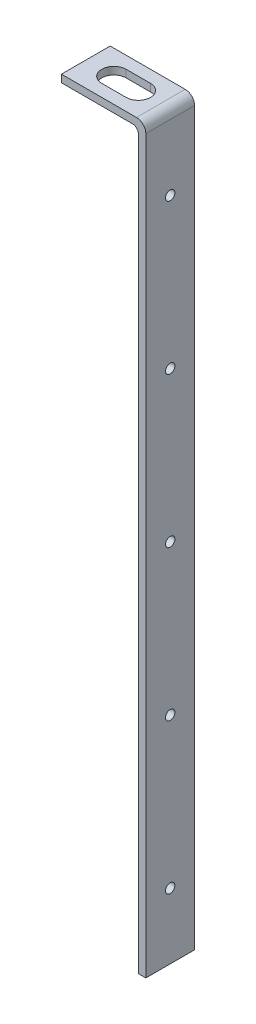
ISO-10303-21;
HEADER;
FILE_DESCRIPTION(('STEP AP214'),'2;1');
FILE_NAME('part.step','',(''),(''),'','','');
FILE_SCHEMA(('AUTOMOTIVE_DESIGN { 1 0 10303 214 1 1 1 1 }'));
ENDSEC;
DATA;
#1=APPLICATION_CONTEXT('core data for automotive mechanical design processes');
#2=APPLICATION_PROTOCOL_DEFINITION('international standard','automotive_design',2000,#1);
#3=PRODUCT_CONTEXT('',#1,'mechanical');
#4=PRODUCT('Part','Part','',(#3));
#5=PRODUCT_RELATED_PRODUCT_CATEGORY('part','',(#4));
#6=PRODUCT_DEFINITION_FORMATION('','',#4);
#7=PRODUCT_DEFINITION_CONTEXT('part definition',#1,'design');
#8=PRODUCT_DEFINITION('design','',#6,#7);
#9=PRODUCT_DEFINITION_SHAPE('','',#8);
#10=(LENGTH_UNIT() NAMED_UNIT(*) SI_UNIT(.MILLI.,.METRE.));
#11=(NAMED_UNIT(*) PLANE_ANGLE_UNIT() SI_UNIT($,.RADIAN.));
#12=(NAMED_UNIT(*) SI_UNIT($,.STERADIAN.) SOLID_ANGLE_UNIT());
#13=UNCERTAINTY_MEASURE_WITH_UNIT(LENGTH_MEASURE(1.E-05),#10,'distance_accuracy_value','');
#14=(GEOMETRIC_REPRESENTATION_CONTEXT(3) GLOBAL_UNCERTAINTY_ASSIGNED_CONTEXT((#13)) GLOBAL_UNIT_ASSIGNED_CONTEXT((#10,
#11,#12)) REPRESENTATION_CONTEXT('',''));
#15=CARTESIAN_POINT('',(0.,0.,0.));
#16=DIRECTION('',(0.,0.,1.));
#17=DIRECTION('',(1.,0.,0.));
#18=AXIS2_PLACEMENT_3D('',#15,#16,#17);
#19=CARTESIAN_POINT('',(-4.,0.,26.));
#20=DIRECTION('',(0.,1.,0.));
#21=DIRECTION('',(0.,0.,1.));
#22=AXIS2_PLACEMENT_3D('',#19,#20,#21);
#23=PLANE('',#22);
#24=DIRECTION('',(1.,0.,0.));
#25=VECTOR('',#24,1.);
#26=CARTESIAN_POINT('',(-4.,0.,0.));
#27=LINE('',#26,#25);
#28=CARTESIAN_POINT('',(-4.,0.,0.));
#29=VERTEX_POINT('',#28);
#30=CARTESIAN_POINT('',(0.,0.,0.));
#31=VERTEX_POINT('',#30);
#32=EDGE_CURVE('E222',#29,#31,#27,.T.);
#33=ORIENTED_EDGE('',*,*,#32,.T.);
#34=DIRECTION('',(0.,0.,-1.));
#35=VECTOR('',#34,1.);
#36=CARTESIAN_POINT('',(0.,0.,26.));
#37=LINE('',#36,#35);
#38=CARTESIAN_POINT('',(0.,0.,26.));
#39=VERTEX_POINT('',#38);
#40=EDGE_CURVE('E253',#39,#31,#37,.T.);
#41=ORIENTED_EDGE('',*,*,#40,.F.);
#42=DIRECTION('',(1.,0.,0.));
#43=VECTOR('',#42,1.);
#44=CARTESIAN_POINT('',(-4.,0.,26.));
#45=LINE('',#44,#43);
#46=CARTESIAN_POINT('',(-4.,0.,26.));
#47=VERTEX_POINT('',#46);
#48=EDGE_CURVE('E200',#47,#39,#45,.T.);
#49=ORIENTED_EDGE('',*,*,#48,.F.);
#50=DIRECTION('',(0.,0.,-1.));
#51=VECTOR('',#50,1.);
#52=CARTESIAN_POINT('',(-4.,0.,26.));
#53=LINE('',#52,#51);
#54=EDGE_CURVE('E221',#47,#29,#53,.T.);
#55=ORIENTED_EDGE('',*,*,#54,.T.);
#56=EDGE_LOOP('',(#33,#41,#49,#55));
#57=FACE_BOUND('',#56,.T.);
#58=ADVANCED_FACE('F47',(#57),#23,.F.);
#59=CARTESIAN_POINT('',(0.,0.,26.));
#60=DIRECTION('',(-1.,0.,0.));
#61=DIRECTION('',(0.,0.,1.));
#62=AXIS2_PLACEMENT_3D('',#59,#60,#61);
#63=PLANE('',#62);
#64=CARTESIAN_POINT('',(0.,355.,13.));
#65=DIRECTION('',(1.,0.,0.));
#66=DIRECTION('',(0.,0.,-1.));
#67=AXIS2_PLACEMENT_3D('',#64,#65,#66);
#68=CIRCLE('',#67,2.5);
#69=CARTESIAN_POINT('',(0.,355.,10.5));
#70=VERTEX_POINT('',#69);
#71=EDGE_CURVE('E175',#70,#70,#68,.T.);
#72=ORIENTED_EDGE('',*,*,#71,.F.);
#73=EDGE_LOOP('',(#72));
#74=FACE_BOUND('',#73,.T.);
#75=CARTESIAN_POINT('',(0.,275.,13.));
#76=DIRECTION('',(1.,0.,0.));
#77=DIRECTION('',(0.,0.,-1.));
#78=AXIS2_PLACEMENT_3D('',#75,#76,#77);
#79=CIRCLE('',#78,2.5);
#80=CARTESIAN_POINT('',(0.,275.,10.5));
#81=VERTEX_POINT('',#80);
#82=EDGE_CURVE('E189',#81,#81,#79,.T.);
#83=ORIENTED_EDGE('',*,*,#82,.F.);
#84=EDGE_LOOP('',(#83));
#85=FACE_BOUND('',#84,.T.);
#86=CARTESIAN_POINT('',(0.,35.,13.));
#87=DIRECTION('',(1.,0.,0.));
#88=DIRECTION('',(0.,0.,-1.));
#89=AXIS2_PLACEMENT_3D('',#86,#87,#88);
#90=CIRCLE('',#89,2.5);
#91=CARTESIAN_POINT('',(0.,35.,10.5));
#92=VERTEX_POINT('',#91);
#93=EDGE_CURVE('E185',#92,#92,#90,.T.);
#94=ORIENTED_EDGE('',*,*,#93,.F.);
#95=EDGE_LOOP('',(#94));
#96=FACE_BOUND('',#95,.T.);
#97=CARTESIAN_POINT('',(0.,115.,13.));
#98=DIRECTION('',(1.,0.,0.));
#99=DIRECTION('',(0.,0.,-1.));
#100=AXIS2_PLACEMENT_3D('',#97,#98,#99);
#101=CIRCLE('',#100,2.5);
#102=CARTESIAN_POINT('',(0.,115.,10.5));
#103=VERTEX_POINT('',#102);
#104=EDGE_CURVE('E180',#103,#103,#101,.T.);
#105=ORIENTED_EDGE('',*,*,#104,.F.);
#106=EDGE_LOOP('',(#105));
#107=FACE_BOUND('',#106,.T.);
#108=CARTESIAN_POINT('',(0.,195.,13.));
#109=DIRECTION('',(1.,0.,0.));
#110=DIRECTION('',(0.,0.,-1.));
#111=AXIS2_PLACEMENT_3D('',#108,#109,#110);
#112=CIRCLE('',#111,2.5);
#113=CARTESIAN_POINT('',(0.,195.,10.5));
#114=VERTEX_POINT('',#113);
#115=EDGE_CURVE('E184',#114,#114,#112,.T.);
#116=ORIENTED_EDGE('',*,*,#115,.F.);
#117=EDGE_LOOP('',(#116));
#118=FACE_BOUND('',#117,.T.);
#119=DIRECTION('',(0.,1.,0.));
#120=VECTOR('',#119,1.);
#121=CARTESIAN_POINT('',(0.,0.,0.));
#122=LINE('',#121,#120);
#123=CARTESIAN_POINT('',(0.,390.,0.));
#124=VERTEX_POINT('',#123);
#125=EDGE_CURVE('E226',#31,#124,#122,.T.);
#126=ORIENTED_EDGE('',*,*,#125,.T.);
#127=DIRECTION('',(0.,0.,-1.));
#128=VECTOR('',#127,1.);
#129=CARTESIAN_POINT('',(0.,390.,26.));
#130=LINE('',#129,#128);
#131=CARTESIAN_POINT('',(0.,390.,26.));
#132=VERTEX_POINT('',#131);
#133=EDGE_CURVE('E56',#124,#132,#130,.F.);
#134=ORIENTED_EDGE('',*,*,#133,.T.);
#135=DIRECTION('',(0.,1.,0.));
#136=VECTOR('',#135,1.);
#137=CARTESIAN_POINT('',(0.,0.,26.));
#138=LINE('',#137,#136);
#139=EDGE_CURVE('E204',#39,#132,#138,.T.);
#140=ORIENTED_EDGE('',*,*,#139,.F.);
#141=ORIENTED_EDGE('',*,*,#40,.T.);
#142=EDGE_LOOP('',(#126,#134,#140,#141));
#143=FACE_BOUND('',#142,.T.);
#144=ADVANCED_FACE('F444',(#74,#85,#96,#107,#118,#143),#63,.F.);
#145=CARTESIAN_POINT('',(0.,395.,26.));
#146=DIRECTION('',(0.,-1.,0.));
#147=DIRECTION('',(0.,0.,-1.));
#148=AXIS2_PLACEMENT_3D('',#145,#146,#147);
#149=PLANE('',#148);
#150=DIRECTION('',(1.,0.,0.));
#151=VECTOR('',#150,1.);
#152=CARTESIAN_POINT('',(-30.,395.,19.5));
#153=LINE('',#152,#151);
#154=CARTESIAN_POINT('',(-30.0000000000003,395.,19.5));
#155=VERTEX_POINT('',#154);
#156=CARTESIAN_POINT('',(-17.,395.,19.5));
#157=VERTEX_POINT('',#156);
#158=EDGE_CURVE('E152',#155,#157,#153,.T.);
#159=ORIENTED_EDGE('',*,*,#158,.F.);
#160=CARTESIAN_POINT('',(-30.,395.,13.));
#161=DIRECTION('',(0.,1.,0.));
#162=DIRECTION('',(-1.,0.,0.));
#163=AXIS2_PLACEMENT_3D('',#160,#161,#162);
#164=CIRCLE('',#163,6.5);
#165=CARTESIAN_POINT('',(-30.,395.,6.5));
#166=VERTEX_POINT('',#165);
#167=EDGE_CURVE('E158',#166,#155,#164,.T.);
#168=ORIENTED_EDGE('',*,*,#167,.F.);
#169=DIRECTION('',(-1.,0.,0.));
#170=VECTOR('',#169,1.);
#171=CARTESIAN_POINT('',(-30.,395.,6.5));
#172=LINE('',#171,#170);
#173=CARTESIAN_POINT('',(-17.,395.,6.5));
#174=VERTEX_POINT('',#173);
#175=EDGE_CURVE('E163',#174,#166,#172,.T.);
#176=ORIENTED_EDGE('',*,*,#175,.F.);
#177=CARTESIAN_POINT('',(-17.,395.,13.));
#178=DIRECTION('',(0.,1.,0.));
#179=DIRECTION('',(-1.,0.,0.));
#180=AXIS2_PLACEMENT_3D('',#177,#178,#179);
#181=CIRCLE('',#180,6.5);
#182=EDGE_CURVE('E140',#157,#174,#181,.T.);
#183=ORIENTED_EDGE('',*,*,#182,.F.);
#184=EDGE_LOOP('',(#159,#168,#176,#183));
#185=FACE_BOUND('',#184,.T.);
#186=DIRECTION('',(-1.,0.,0.));
#187=VECTOR('',#186,1.);
#188=CARTESIAN_POINT('',(0.,395.,26.));
#189=LINE('',#188,#187);
#190=CARTESIAN_POINT('',(-5.,395.,26.));
#191=VERTEX_POINT('',#190);
#192=CARTESIAN_POINT('',(-45.,395.,26.));
#193=VERTEX_POINT('',#192);
#194=EDGE_CURVE('E208',#191,#193,#189,.T.);
#195=ORIENTED_EDGE('',*,*,#194,.F.);
#196=DIRECTION('',(0.,0.,-1.));
#197=VECTOR('',#196,1.);
#198=CARTESIAN_POINT('',(-5.,395.,26.));
#199=LINE('',#198,#197);
#200=CARTESIAN_POINT('',(-5.,395.,0.));
#201=VERTEX_POINT('',#200);
#202=EDGE_CURVE('E301',#191,#201,#199,.T.);
#203=ORIENTED_EDGE('',*,*,#202,.T.);
#204=DIRECTION('',(-1.,0.,0.));
#205=VECTOR('',#204,1.);
#206=CARTESIAN_POINT('',(0.,395.,0.));
#207=LINE('',#206,#205);
#208=CARTESIAN_POINT('',(-45.,395.,0.));
#209=VERTEX_POINT('',#208);
#210=EDGE_CURVE('E230',#201,#209,#207,.T.);
#211=ORIENTED_EDGE('',*,*,#210,.T.);
#212=DIRECTION('',(0.,0.,-1.));
#213=VECTOR('',#212,1.);
#214=CARTESIAN_POINT('',(-45.,395.,26.));
#215=LINE('',#214,#213);
#216=EDGE_CURVE('E249',#193,#209,#215,.T.);
#217=ORIENTED_EDGE('',*,*,#216,.F.);
#218=EDGE_LOOP('',(#195,#203,#211,#217));
#219=FACE_BOUND('',#218,.T.);
#220=ADVANCED_FACE('F160',(#185,#219),#149,.F.);
#221=CARTESIAN_POINT('',(-45.,395.,26.));
#222=DIRECTION('',(1.,0.,0.));
#223=DIRECTION('',(0.,0.,-1.));
#224=AXIS2_PLACEMENT_3D('',#221,#222,#223);
#225=PLANE('',#224);
#226=DIRECTION('',(0.,-1.,0.));
#227=VECTOR('',#226,1.);
#228=CARTESIAN_POINT('',(-45.,395.,0.));
#229=LINE('',#228,#227);
#230=CARTESIAN_POINT('',(-45.,391.,0.));
#231=VERTEX_POINT('',#230);
#232=EDGE_CURVE('E233',#209,#231,#229,.T.);
#233=ORIENTED_EDGE('',*,*,#232,.T.);
#234=DIRECTION('',(0.,0.,-1.));
#235=VECTOR('',#234,1.);
#236=CARTESIAN_POINT('',(-45.,391.,26.));
#237=LINE('',#236,#235);
#238=CARTESIAN_POINT('',(-45.,391.,26.));
#239=VERTEX_POINT('',#238);
#240=EDGE_CURVE('E245',#239,#231,#237,.T.);
#241=ORIENTED_EDGE('',*,*,#240,.F.);
#242=DIRECTION('',(0.,-1.,0.));
#243=VECTOR('',#242,1.);
#244=CARTESIAN_POINT('',(-45.,395.,26.));
#245=LINE('',#244,#243);
#246=EDGE_CURVE('E211',#193,#239,#245,.T.);
#247=ORIENTED_EDGE('',*,*,#246,.F.);
#248=ORIENTED_EDGE('',*,*,#216,.T.);
#249=EDGE_LOOP('',(#233,#241,#247,#248));
#250=FACE_BOUND('',#249,.T.);
#251=ADVANCED_FACE('F408',(#250),#225,.F.);
#252=CARTESIAN_POINT('',(-4.,391.,26.));
#253=DIRECTION('',(0.,1.,0.));
#254=DIRECTION('',(0.,0.,1.));
#255=AXIS2_PLACEMENT_3D('',#252,#253,#254);
#256=PLANE('',#255);
#257=DIRECTION('',(-1.,0.,0.));
#258=VECTOR('',#257,1.);
#259=CARTESIAN_POINT('',(-4.,391.,6.5));
#260=LINE('',#259,#258);
#261=CARTESIAN_POINT('',(-17.,391.,6.5));
#262=VERTEX_POINT('',#261);
#263=CARTESIAN_POINT('',(-30.,391.,6.5));
#264=VERTEX_POINT('',#263);
#265=EDGE_CURVE('E280',#262,#264,#260,.T.);
#266=ORIENTED_EDGE('',*,*,#265,.T.);
#267=CARTESIAN_POINT('',(-30.,391.,13.));
#268=DIRECTION('',(0.,1.,0.));
#269=DIRECTION('',(0.,0.,1.));
#270=AXIS2_PLACEMENT_3D('',#267,#268,#269);
#271=CIRCLE('',#270,6.5);
#272=CARTESIAN_POINT('',(-30.,391.,19.5));
#273=VERTEX_POINT('',#272);
#274=EDGE_CURVE('E284',#264,#273,#271,.T.);
#275=ORIENTED_EDGE('',*,*,#274,.T.);
#276=DIRECTION('',(1.,0.,0.));
#277=VECTOR('',#276,1.);
#278=CARTESIAN_POINT('',(-4.,391.,19.5));
#279=LINE('',#278,#277);
#280=CARTESIAN_POINT('',(-17.,391.,19.5));
#281=VERTEX_POINT('',#280);
#282=EDGE_CURVE('E257',#273,#281,#279,.T.);
#283=ORIENTED_EDGE('',*,*,#282,.T.);
#284=CARTESIAN_POINT('',(-17.,391.,13.));
#285=DIRECTION('',(0.,1.,0.));
#286=DIRECTION('',(0.,0.,1.));
#287=AXIS2_PLACEMENT_3D('',#284,#285,#286);
#288=CIRCLE('',#287,6.5);
#289=EDGE_CURVE('E143',#281,#262,#288,.T.);
#290=ORIENTED_EDGE('',*,*,#289,.T.);
#291=EDGE_LOOP('',(#266,#275,#283,#290));
#292=FACE_BOUND('',#291,.T.);
#293=DIRECTION('',(1.,0.,0.));
#294=VECTOR('',#293,1.);
#295=CARTESIAN_POINT('',(-4.,391.,0.));
#296=LINE('',#295,#294);
#297=CARTESIAN_POINT('',(-7.,391.,0.));
#298=VERTEX_POINT('',#297);
#299=EDGE_CURVE('E236',#231,#298,#296,.T.);
#300=ORIENTED_EDGE('',*,*,#299,.T.);
#301=DIRECTION('',(0.,0.,-1.));
#302=VECTOR('',#301,1.);
#303=CARTESIAN_POINT('',(-7.,391.,26.));
#304=LINE('',#303,#302);
#305=CARTESIAN_POINT('',(-7.,391.,26.));
#306=VERTEX_POINT('',#305);
#307=EDGE_CURVE('E292',#298,#306,#304,.F.);
#308=ORIENTED_EDGE('',*,*,#307,.T.);
#309=DIRECTION('',(1.,0.,0.));
#310=VECTOR('',#309,1.);
#311=CARTESIAN_POINT('',(-4.,391.,26.));
#312=LINE('',#311,#310);
#313=EDGE_CURVE('E214',#239,#306,#312,.T.);
#314=ORIENTED_EDGE('',*,*,#313,.F.);
#315=ORIENTED_EDGE('',*,*,#240,.T.);
#316=EDGE_LOOP('',(#300,#308,#314,#315));
#317=FACE_BOUND('',#316,.T.);
#318=ADVANCED_FACE('F404',(#292,#317),#256,.F.);
#319=CARTESIAN_POINT('',(-4.,0.,26.));
#320=DIRECTION('',(1.,0.,0.));
#321=DIRECTION('',(0.,0.,-1.));
#322=AXIS2_PLACEMENT_3D('',#319,#320,#321);
#323=PLANE('',#322);
#324=CARTESIAN_POINT('',(-4.00000000000001,355.,13.));
#325=DIRECTION('',(1.,0.,0.));
#326=DIRECTION('',(0.,0.,-1.));
#327=AXIS2_PLACEMENT_3D('',#324,#325,#326);
#328=CIRCLE('',#327,2.5);
#329=CARTESIAN_POINT('',(-4.00000000000001,355.,10.5));
#330=VERTEX_POINT('',#329);
#331=EDGE_CURVE('E227',#330,#330,#328,.T.);
#332=ORIENTED_EDGE('',*,*,#331,.T.);
#333=EDGE_LOOP('',(#332));
#334=FACE_BOUND('',#333,.T.);
#335=CARTESIAN_POINT('',(-4.00000000000001,275.,13.));
#336=DIRECTION('',(1.,0.,0.));
#337=DIRECTION('',(0.,0.,-1.));
#338=AXIS2_PLACEMENT_3D('',#335,#336,#337);
#339=CIRCLE('',#338,2.5);
#340=CARTESIAN_POINT('',(-4.00000000000001,275.,10.5));
#341=VERTEX_POINT('',#340);
#342=EDGE_CURVE('E269',#341,#341,#339,.T.);
#343=ORIENTED_EDGE('',*,*,#342,.T.);
#344=EDGE_LOOP('',(#343));
#345=FACE_BOUND('',#344,.T.);
#346=CARTESIAN_POINT('',(-4.00000000000001,35.,13.));
#347=DIRECTION('',(1.,0.,0.));
#348=DIRECTION('',(0.,0.,-1.));
#349=AXIS2_PLACEMENT_3D('',#346,#347,#348);
#350=CIRCLE('',#349,2.5);
#351=CARTESIAN_POINT('',(-4.00000000000001,35.,10.5));
#352=VERTEX_POINT('',#351);
#353=EDGE_CURVE('E265',#352,#352,#350,.T.);
#354=ORIENTED_EDGE('',*,*,#353,.T.);
#355=EDGE_LOOP('',(#354));
#356=FACE_BOUND('',#355,.T.);
#357=CARTESIAN_POINT('',(-4.00000000000001,115.,13.));
#358=DIRECTION('',(1.,0.,0.));
#359=DIRECTION('',(0.,0.,-1.));
#360=AXIS2_PLACEMENT_3D('',#357,#358,#359);
#361=CIRCLE('',#360,2.5);
#362=CARTESIAN_POINT('',(-4.00000000000001,115.,10.5));
#363=VERTEX_POINT('',#362);
#364=EDGE_CURVE('E261',#363,#363,#361,.T.);
#365=ORIENTED_EDGE('',*,*,#364,.T.);
#366=EDGE_LOOP('',(#365));
#367=FACE_BOUND('',#366,.T.);
#368=CARTESIAN_POINT('',(-4.00000000000001,195.,13.));
#369=DIRECTION('',(1.,0.,0.));
#370=DIRECTION('',(0.,0.,-1.));
#371=AXIS2_PLACEMENT_3D('',#368,#369,#370);
#372=CIRCLE('',#371,2.5);
#373=CARTESIAN_POINT('',(-4.00000000000001,195.,10.5));
#374=VERTEX_POINT('',#373);
#375=EDGE_CURVE('E199',#374,#374,#372,.T.);
#376=ORIENTED_EDGE('',*,*,#375,.T.);
#377=EDGE_LOOP('',(#376));
#378=FACE_BOUND('',#377,.T.);
#379=DIRECTION('',(0.,-1.,0.));
#380=VECTOR('',#379,1.);
#381=CARTESIAN_POINT('',(-4.,0.,26.));
#382=LINE('',#381,#380);
#383=CARTESIAN_POINT('',(-4.,388.,26.));
#384=VERTEX_POINT('',#383);
#385=EDGE_CURVE('E218',#384,#47,#382,.T.);
#386=ORIENTED_EDGE('',*,*,#385,.F.);
#387=DIRECTION('',(0.,0.,-1.));
#388=VECTOR('',#387,1.);
#389=CARTESIAN_POINT('',(-4.,388.,0.));
#390=LINE('',#389,#388);
#391=CARTESIAN_POINT('',(-4.,388.,0.));
#392=VERTEX_POINT('',#391);
#393=EDGE_CURVE('E288',#384,#392,#390,.T.);
#394=ORIENTED_EDGE('',*,*,#393,.T.);
#395=DIRECTION('',(0.,-1.,0.));
#396=VECTOR('',#395,1.);
#397=CARTESIAN_POINT('',(-4.,0.,0.));
#398=LINE('',#397,#396);
#399=EDGE_CURVE('E205',#392,#29,#398,.T.);
#400=ORIENTED_EDGE('',*,*,#399,.T.);
#401=ORIENTED_EDGE('',*,*,#54,.F.);
#402=EDGE_LOOP('',(#386,#394,#400,#401));
#403=FACE_BOUND('',#402,.T.);
#404=ADVANCED_FACE('F407',(#334,#345,#356,#367,#378,#403),#323,.F.);
#405=CARTESIAN_POINT('',(0.,0.,26.));
#406=DIRECTION('',(0.,0.,1.));
#407=DIRECTION('',(1.,0.,0.));
#408=AXIS2_PLACEMENT_3D('',#405,#406,#407);
#409=PLANE('',#408);
#410=ORIENTED_EDGE('',*,*,#139,.T.);
#411=CARTESIAN_POINT('',(-5.,390.,26.));
#412=DIRECTION('',(0.,0.,1.));
#413=DIRECTION('',(1.,0.,0.));
#414=AXIS2_PLACEMENT_3D('',#411,#412,#413);
#415=CIRCLE('',#414,5.);
#416=EDGE_CURVE('E11',#132,#191,#415,.T.);
#417=ORIENTED_EDGE('',*,*,#416,.T.);
#418=ORIENTED_EDGE('',*,*,#194,.T.);
#419=ORIENTED_EDGE('',*,*,#246,.T.);
#420=ORIENTED_EDGE('',*,*,#313,.T.);
#421=CARTESIAN_POINT('',(-7.,388.,26.));
#422=DIRECTION('',(0.,0.,1.));
#423=DIRECTION('',(1.,0.,0.));
#424=AXIS2_PLACEMENT_3D('',#421,#422,#423);
#425=CIRCLE('',#424,3.);
#426=EDGE_CURVE('E298',#306,#384,#425,.F.);
#427=ORIENTED_EDGE('',*,*,#426,.T.);
#428=ORIENTED_EDGE('',*,*,#385,.T.);
#429=ORIENTED_EDGE('',*,*,#48,.T.);
#430=EDGE_LOOP('',(#410,#417,#418,#419,#420,#427,#428,#429));
#431=FACE_BOUND('',#430,.T.);
#432=ADVANCED_FACE('F421',(#431),#409,.T.);
#433=CARTESIAN_POINT('',(0.,0.,0.));
#434=DIRECTION('',(0.,0.,1.));
#435=DIRECTION('',(1.,0.,0.));
#436=AXIS2_PLACEMENT_3D('',#433,#434,#435);
#437=PLANE('',#436);
#438=ORIENTED_EDGE('',*,*,#210,.F.);
#439=CARTESIAN_POINT('',(-5.,390.,0.));
#440=DIRECTION('',(0.,0.,1.));
#441=DIRECTION('',(1.,0.,0.));
#442=AXIS2_PLACEMENT_3D('',#439,#440,#441);
#443=CIRCLE('',#442,5.);
#444=EDGE_CURVE('E70',#201,#124,#443,.F.);
#445=ORIENTED_EDGE('',*,*,#444,.T.);
#446=ORIENTED_EDGE('',*,*,#125,.F.);
#447=ORIENTED_EDGE('',*,*,#32,.F.);
#448=ORIENTED_EDGE('',*,*,#399,.F.);
#449=CARTESIAN_POINT('',(-7.,388.,0.));
#450=DIRECTION('',(0.,0.,1.));
#451=DIRECTION('',(1.,0.,0.));
#452=AXIS2_PLACEMENT_3D('',#449,#450,#451);
#453=CIRCLE('',#452,3.);
#454=EDGE_CURVE('E295',#392,#298,#453,.T.);
#455=ORIENTED_EDGE('',*,*,#454,.T.);
#456=ORIENTED_EDGE('',*,*,#299,.F.);
#457=ORIENTED_EDGE('',*,*,#232,.F.);
#458=EDGE_LOOP('',(#438,#445,#446,#447,#448,#455,#456,#457));
#459=FACE_BOUND('',#458,.T.);
#460=ADVANCED_FACE('F434',(#459),#437,.F.);
#461=CARTESIAN_POINT('',(-45.,195.,13.));
#462=DIRECTION('',(1.,0.,0.));
#463=DIRECTION('',(0.,0.,-1.));
#464=AXIS2_PLACEMENT_3D('',#461,#462,#463);
#465=CYLINDRICAL_SURFACE('',#464,2.5);
#466=ORIENTED_EDGE('',*,*,#115,.T.);
#467=EDGE_LOOP('',(#466));
#468=FACE_BOUND('',#467,.T.);
#469=ORIENTED_EDGE('',*,*,#375,.F.);
#470=EDGE_LOOP('',(#469));
#471=FACE_BOUND('',#470,.T.);
#472=ADVANCED_FACE('F472',(#468,#471),#465,.F.);
#473=CARTESIAN_POINT('',(-45.,115.,13.));
#474=DIRECTION('',(1.,0.,0.));
#475=DIRECTION('',(0.,0.,-1.));
#476=AXIS2_PLACEMENT_3D('',#473,#474,#475);
#477=CYLINDRICAL_SURFACE('',#476,2.5);
#478=ORIENTED_EDGE('',*,*,#104,.T.);
#479=EDGE_LOOP('',(#478));
#480=FACE_BOUND('',#479,.T.);
#481=ORIENTED_EDGE('',*,*,#364,.F.);
#482=EDGE_LOOP('',(#481));
#483=FACE_BOUND('',#482,.T.);
#484=ADVANCED_FACE('F468',(#480,#483),#477,.F.);
#485=CARTESIAN_POINT('',(-45.,35.,13.));
#486=DIRECTION('',(1.,0.,0.));
#487=DIRECTION('',(0.,0.,-1.));
#488=AXIS2_PLACEMENT_3D('',#485,#486,#487);
#489=CYLINDRICAL_SURFACE('',#488,2.5);
#490=ORIENTED_EDGE('',*,*,#93,.T.);
#491=EDGE_LOOP('',(#490));
#492=FACE_BOUND('',#491,.T.);
#493=ORIENTED_EDGE('',*,*,#353,.F.);
#494=EDGE_LOOP('',(#493));
#495=FACE_BOUND('',#494,.T.);
#496=ADVANCED_FACE('F471',(#492,#495),#489,.F.);
#497=CARTESIAN_POINT('',(-45.,275.,13.));
#498=DIRECTION('',(1.,0.,0.));
#499=DIRECTION('',(0.,0.,-1.));
#500=AXIS2_PLACEMENT_3D('',#497,#498,#499);
#501=CYLINDRICAL_SURFACE('',#500,2.5);
#502=ORIENTED_EDGE('',*,*,#82,.T.);
#503=EDGE_LOOP('',(#502));
#504=FACE_BOUND('',#503,.T.);
#505=ORIENTED_EDGE('',*,*,#342,.F.);
#506=EDGE_LOOP('',(#505));
#507=FACE_BOUND('',#506,.T.);
#508=ADVANCED_FACE('F476',(#504,#507),#501,.F.);
#509=CARTESIAN_POINT('',(-45.,355.,13.));
#510=DIRECTION('',(1.,0.,0.));
#511=DIRECTION('',(0.,0.,-1.));
#512=AXIS2_PLACEMENT_3D('',#509,#510,#511);
#513=CYLINDRICAL_SURFACE('',#512,2.5);
#514=ORIENTED_EDGE('',*,*,#71,.T.);
#515=EDGE_LOOP('',(#514));
#516=FACE_BOUND('',#515,.T.);
#517=ORIENTED_EDGE('',*,*,#331,.F.);
#518=EDGE_LOOP('',(#517));
#519=FACE_BOUND('',#518,.T.);
#520=ADVANCED_FACE('F467',(#516,#519),#513,.F.);
#521=CARTESIAN_POINT('',(-30.0000000000003,0.,13.));
#522=DIRECTION('',(0.,1.,0.));
#523=DIRECTION('',(-1.,0.,0.));
#524=AXIS2_PLACEMENT_3D('',#521,#522,#523);
#525=CYLINDRICAL_SURFACE('',#524,6.5);
#526=DIRECTION('',(0.,1.,0.));
#527=VECTOR('',#526,1.);
#528=CARTESIAN_POINT('',(-30.0000000000003,0.,6.5));
#529=LINE('',#528,#527);
#530=EDGE_CURVE('E172',#264,#166,#529,.T.);
#531=ORIENTED_EDGE('',*,*,#530,.T.);
#532=ORIENTED_EDGE('',*,*,#167,.T.);
#533=DIRECTION('',(0.,1.,0.));
#534=VECTOR('',#533,1.);
#535=CARTESIAN_POINT('',(-30.0000000000003,0.,19.5));
#536=LINE('',#535,#534);
#537=EDGE_CURVE('E148',#273,#155,#536,.T.);
#538=ORIENTED_EDGE('',*,*,#537,.F.);
#539=ORIENTED_EDGE('',*,*,#274,.F.);
#540=EDGE_LOOP('',(#531,#532,#538,#539));
#541=FACE_BOUND('',#540,.T.);
#542=ADVANCED_FACE('F399',(#541),#525,.F.);
#543=CARTESIAN_POINT('',(-30.0000000000003,0.,6.5));
#544=DIRECTION('',(0.,0.,-1.));
#545=DIRECTION('',(-1.,0.,0.));
#546=AXIS2_PLACEMENT_3D('',#543,#544,#545);
#547=PLANE('',#546);
#548=DIRECTION('',(0.,1.,0.));
#549=VECTOR('',#548,1.);
#550=CARTESIAN_POINT('',(-17.0000000000003,0.,6.5));
#551=LINE('',#550,#549);
#552=EDGE_CURVE('E147',#262,#174,#551,.T.);
#553=ORIENTED_EDGE('',*,*,#552,.T.);
#554=ORIENTED_EDGE('',*,*,#175,.T.);
#555=ORIENTED_EDGE('',*,*,#530,.F.);
#556=ORIENTED_EDGE('',*,*,#265,.F.);
#557=EDGE_LOOP('',(#553,#554,#555,#556));
#558=FACE_BOUND('',#557,.T.);
#559=ADVANCED_FACE('F402',(#558),#547,.F.);
#560=CARTESIAN_POINT('',(-17.0000000000003,0.,13.));
#561=DIRECTION('',(0.,1.,0.));
#562=DIRECTION('',(-1.,0.,0.));
#563=AXIS2_PLACEMENT_3D('',#560,#561,#562);
#564=CYLINDRICAL_SURFACE('',#563,6.5);
#565=DIRECTION('',(0.,1.,0.));
#566=VECTOR('',#565,1.);
#567=CARTESIAN_POINT('',(-17.0000000000003,0.,19.5));
#568=LINE('',#567,#566);
#569=EDGE_CURVE('E135',#281,#157,#568,.T.);
#570=ORIENTED_EDGE('',*,*,#569,.T.);
#571=ORIENTED_EDGE('',*,*,#182,.T.);
#572=ORIENTED_EDGE('',*,*,#552,.F.);
#573=ORIENTED_EDGE('',*,*,#289,.F.);
#574=EDGE_LOOP('',(#570,#571,#572,#573));
#575=FACE_BOUND('',#574,.T.);
#576=ADVANCED_FACE('F137',(#575),#564,.F.);
#577=CARTESIAN_POINT('',(-30.0000000000003,0.,19.5));
#578=DIRECTION('',(0.,0.,1.));
#579=DIRECTION('',(1.,0.,0.));
#580=AXIS2_PLACEMENT_3D('',#577,#578,#579);
#581=PLANE('',#580);
#582=ORIENTED_EDGE('',*,*,#537,.T.);
#583=ORIENTED_EDGE('',*,*,#158,.T.);
#584=ORIENTED_EDGE('',*,*,#569,.F.);
#585=ORIENTED_EDGE('',*,*,#282,.F.);
#586=EDGE_LOOP('',(#582,#583,#584,#585));
#587=FACE_BOUND('',#586,.T.);
#588=ADVANCED_FACE('F153',(#587),#581,.F.);
#589=CARTESIAN_POINT('',(-7.,388.,26.));
#590=DIRECTION('',(0.,0.,1.));
#591=DIRECTION('',(1.,0.,0.));
#592=AXIS2_PLACEMENT_3D('',#589,#590,#591);
#593=CYLINDRICAL_SURFACE('',#592,3.);
#594=ORIENTED_EDGE('',*,*,#426,.F.);
#595=ORIENTED_EDGE('',*,*,#307,.F.);
#596=ORIENTED_EDGE('',*,*,#454,.F.);
#597=ORIENTED_EDGE('',*,*,#393,.F.);
#598=EDGE_LOOP('',(#594,#595,#596,#597));
#599=FACE_BOUND('',#598,.T.);
#600=ADVANCED_FACE('F417',(#599),#593,.F.);
#601=CARTESIAN_POINT('',(-5.,390.,26.));
#602=DIRECTION('',(0.,0.,-1.));
#603=DIRECTION('',(-1.,0.,0.));
#604=AXIS2_PLACEMENT_3D('',#601,#602,#603);
#605=CYLINDRICAL_SURFACE('',#604,5.);
#606=ORIENTED_EDGE('',*,*,#416,.F.);
#607=ORIENTED_EDGE('',*,*,#133,.F.);
#608=ORIENTED_EDGE('',*,*,#444,.F.);
#609=ORIENTED_EDGE('',*,*,#202,.F.);
#610=EDGE_LOOP('',(#606,#607,#608,#609));
#611=FACE_BOUND('',#610,.T.);
#612=ADVANCED_FACE('F49',(#611),#605,.T.);
#613=CLOSED_SHELL('',(#58,#144,#220,#251,#318,#404,#432,#460,#472,#484,#496,#508,#520,#542,#559,
#576,#588,#600,#612));
#614=MANIFOLD_SOLID_BREP('B2',#613);
#615=ADVANCED_BREP_SHAPE_REPRESENTATION('',(#18,#614),#14);
#616=SHAPE_DEFINITION_REPRESENTATION(#9,#615);
ENDSEC;
END-ISO-10303-21;
